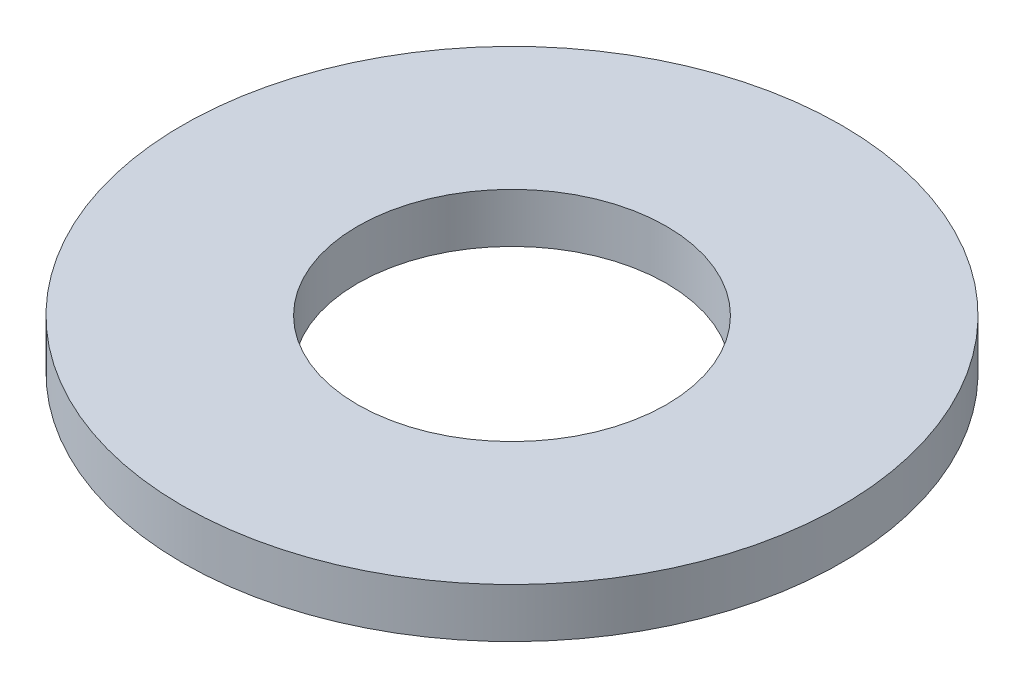
ISO-10303-21;
HEADER;
FILE_DESCRIPTION(('STEP AP214'),'2;1');
FILE_NAME('part.step','',(''),(''),'','','');
FILE_SCHEMA(('AUTOMOTIVE_DESIGN { 1 0 10303 214 1 1 1 1 }'));
ENDSEC;
DATA;
#1=APPLICATION_CONTEXT('core data for automotive mechanical design processes');
#2=APPLICATION_PROTOCOL_DEFINITION('international standard','automotive_design',2000,#1);
#3=PRODUCT_CONTEXT('',#1,'mechanical');
#4=PRODUCT('Part','Part','',(#3));
#5=PRODUCT_RELATED_PRODUCT_CATEGORY('part','',(#4));
#6=PRODUCT_DEFINITION_FORMATION('','',#4);
#7=PRODUCT_DEFINITION_CONTEXT('part definition',#1,'design');
#8=PRODUCT_DEFINITION('design','',#6,#7);
#9=PRODUCT_DEFINITION_SHAPE('','',#8);
#10=(LENGTH_UNIT() NAMED_UNIT(*) SI_UNIT(.MILLI.,.METRE.));
#11=(NAMED_UNIT(*) PLANE_ANGLE_UNIT() SI_UNIT($,.RADIAN.));
#12=(NAMED_UNIT(*) SI_UNIT($,.STERADIAN.) SOLID_ANGLE_UNIT());
#13=UNCERTAINTY_MEASURE_WITH_UNIT(LENGTH_MEASURE(1.E-05),#10,'distance_accuracy_value','');
#14=(GEOMETRIC_REPRESENTATION_CONTEXT(3) GLOBAL_UNCERTAINTY_ASSIGNED_CONTEXT((#13)) GLOBAL_UNIT_ASSIGNED_CONTEXT((#10,
#11,#12)) REPRESENTATION_CONTEXT('',''));
#15=CARTESIAN_POINT('',(0.,0.,0.));
#16=DIRECTION('',(0.,0.,1.));
#17=DIRECTION('',(1.,0.,0.));
#18=AXIS2_PLACEMENT_3D('',#15,#16,#17);
#19=CARTESIAN_POINT('',(0.,12.,0.));
#20=DIRECTION('',(0.,-1.,0.));
#21=DIRECTION('',(0.,0.,-1.));
#22=AXIS2_PLACEMENT_3D('',#19,#20,#21);
#23=CYLINDRICAL_SURFACE('',#22,80.);
#24=CARTESIAN_POINT('',(0.,12.,0.));
#25=DIRECTION('',(0.,1.,0.));
#26=DIRECTION('',(0.,0.,1.));
#27=AXIS2_PLACEMENT_3D('',#24,#25,#26);
#28=CIRCLE('',#27,80.);
#29=CARTESIAN_POINT('',(0.,12.,80.));
#30=VERTEX_POINT('',#29);
#31=EDGE_CURVE('E10',#30,#30,#28,.T.);
#32=ORIENTED_EDGE('',*,*,#31,.F.);
#33=EDGE_LOOP('',(#32));
#34=FACE_BOUND('',#33,.T.);
#35=CARTESIAN_POINT('',(0.,0.,0.));
#36=DIRECTION('',(0.,1.,0.));
#37=DIRECTION('',(0.,0.,1.));
#38=AXIS2_PLACEMENT_3D('',#35,#36,#37);
#39=CIRCLE('',#38,80.);
#40=CARTESIAN_POINT('',(0.,0.,80.));
#41=VERTEX_POINT('',#40);
#42=EDGE_CURVE('E37',#41,#41,#39,.T.);
#43=ORIENTED_EDGE('',*,*,#42,.T.);
#44=EDGE_LOOP('',(#43));
#45=FACE_BOUND('',#44,.T.);
#46=ADVANCED_FACE('F40',(#34,#45),#23,.T.);
#47=CARTESIAN_POINT('',(0.,12.,0.));
#48=DIRECTION('',(0.,1.,0.));
#49=DIRECTION('',(0.,0.,1.));
#50=AXIS2_PLACEMENT_3D('',#47,#48,#49);
#51=PLANE('',#50);
#52=CARTESIAN_POINT('',(0.,12.,0.));
#53=DIRECTION('',(0.,1.,0.));
#54=DIRECTION('',(0.,0.,1.));
#55=AXIS2_PLACEMENT_3D('',#52,#53,#54);
#56=CIRCLE('',#55,37.5);
#57=CARTESIAN_POINT('',(0.,12.,37.5));
#58=VERTEX_POINT('',#57);
#59=EDGE_CURVE('E50',#58,#58,#56,.T.);
#60=ORIENTED_EDGE('',*,*,#59,.F.);
#61=EDGE_LOOP('',(#60));
#62=FACE_BOUND('',#61,.T.);
#63=ORIENTED_EDGE('',*,*,#31,.T.);
#64=EDGE_LOOP('',(#63));
#65=FACE_BOUND('',#64,.T.);
#66=ADVANCED_FACE('F59',(#62,#65),#51,.T.);
#67=CARTESIAN_POINT('',(0.,0.,0.));
#68=DIRECTION('',(0.,1.,0.));
#69=DIRECTION('',(0.,0.,1.));
#70=AXIS2_PLACEMENT_3D('',#67,#68,#69);
#71=PLANE('',#70);
#72=CARTESIAN_POINT('',(0.,0.,0.));
#73=DIRECTION('',(0.,1.,0.));
#74=DIRECTION('',(0.,0.,1.));
#75=AXIS2_PLACEMENT_3D('',#72,#73,#74);
#76=CIRCLE('',#75,37.5);
#77=CARTESIAN_POINT('',(0.,0.,37.5));
#78=VERTEX_POINT('',#77);
#79=EDGE_CURVE('E47',#78,#78,#76,.T.);
#80=ORIENTED_EDGE('',*,*,#79,.T.);
#81=EDGE_LOOP('',(#80));
#82=FACE_BOUND('',#81,.T.);
#83=ORIENTED_EDGE('',*,*,#42,.F.);
#84=EDGE_LOOP('',(#83));
#85=FACE_BOUND('',#84,.T.);
#86=ADVANCED_FACE('F58',(#82,#85),#71,.F.);
#87=CARTESIAN_POINT('',(0.,12.,0.));
#88=DIRECTION('',(0.,-1.,0.));
#89=DIRECTION('',(0.,0.,-1.));
#90=AXIS2_PLACEMENT_3D('',#87,#88,#89);
#91=CYLINDRICAL_SURFACE('',#90,37.5);
#92=ORIENTED_EDGE('',*,*,#59,.T.);
#93=EDGE_LOOP('',(#92));
#94=FACE_BOUND('',#93,.T.);
#95=ORIENTED_EDGE('',*,*,#79,.F.);
#96=EDGE_LOOP('',(#95));
#97=FACE_BOUND('',#96,.T.);
#98=ADVANCED_FACE('F54',(#94,#97),#91,.F.);
#99=CLOSED_SHELL('',(#46,#66,#86,#98));
#100=MANIFOLD_SOLID_BREP('B2',#99);
#101=ADVANCED_BREP_SHAPE_REPRESENTATION('',(#18,#100),#14);
#102=SHAPE_DEFINITION_REPRESENTATION(#9,#101);
ENDSEC;
END-ISO-10303-21;
